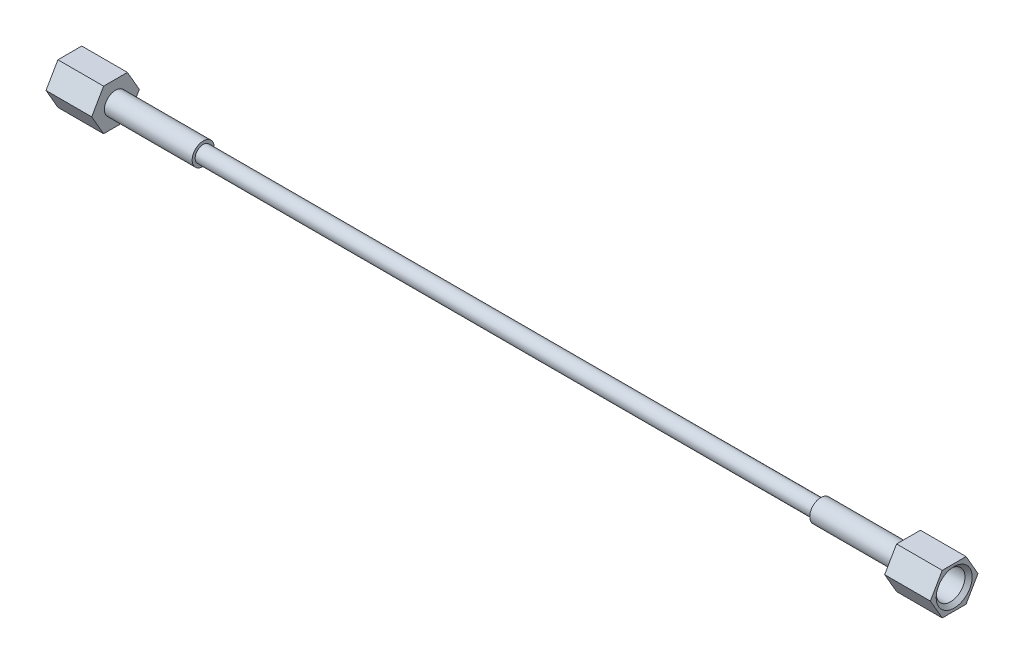
ISO-10303-21;
HEADER;
FILE_DESCRIPTION(('STEP AP214'),'2;1');
FILE_NAME('part.step','',(''),(''),'','','');
FILE_SCHEMA(('AUTOMOTIVE_DESIGN { 1 0 10303 214 1 1 1 1 }'));
ENDSEC;
DATA;
#1=APPLICATION_CONTEXT('core data for automotive mechanical design processes');
#2=APPLICATION_PROTOCOL_DEFINITION('international standard','automotive_design',2000,#1);
#3=PRODUCT_CONTEXT('',#1,'mechanical');
#4=PRODUCT('Part','Part','',(#3));
#5=PRODUCT_RELATED_PRODUCT_CATEGORY('part','',(#4));
#6=PRODUCT_DEFINITION_FORMATION('','',#4);
#7=PRODUCT_DEFINITION_CONTEXT('part definition',#1,'design');
#8=PRODUCT_DEFINITION('design','',#6,#7);
#9=PRODUCT_DEFINITION_SHAPE('','',#8);
#10=(LENGTH_UNIT() NAMED_UNIT(*) SI_UNIT(.MILLI.,.METRE.));
#11=(NAMED_UNIT(*) PLANE_ANGLE_UNIT() SI_UNIT($,.RADIAN.));
#12=(NAMED_UNIT(*) SI_UNIT($,.STERADIAN.) SOLID_ANGLE_UNIT());
#13=UNCERTAINTY_MEASURE_WITH_UNIT(LENGTH_MEASURE(1.E-05),#10,'distance_accuracy_value','');
#14=(GEOMETRIC_REPRESENTATION_CONTEXT(3) GLOBAL_UNCERTAINTY_ASSIGNED_CONTEXT((#13)) GLOBAL_UNIT_ASSIGNED_CONTEXT((#10,
#11,#12)) REPRESENTATION_CONTEXT('',''));
#15=CARTESIAN_POINT('',(0.,0.,0.));
#16=DIRECTION('',(0.,0.,1.));
#17=DIRECTION('',(1.,0.,0.));
#18=AXIS2_PLACEMENT_3D('',#15,#16,#17);
#19=CARTESIAN_POINT('',(-295.91,0.,-8.21223022895325));
#20=DIRECTION('',(0.,-0.500000000000001,0.866025403784438));
#21=DIRECTION('',(0.,-0.866025403784438,-0.500000000000001));
#22=AXIS2_PLACEMENT_3D('',#19,#20,#21);
#23=PLANE('',#22);
#24=DIRECTION('',(0.,0.866025403784438,0.500000000000001));
#25=VECTOR('',#24,1.);
#26=CARTESIAN_POINT('',(-280.162,0.,-8.21223022895325));
#27=LINE('',#26,#25);
#28=CARTESIAN_POINT('',(-280.162,0.,-8.21223022895325));
#29=VERTEX_POINT('',#28);
#30=CARTESIAN_POINT('',(-280.162,7.112,-4.10611511447662));
#31=VERTEX_POINT('',#30);
#32=EDGE_CURVE('E128',#29,#31,#27,.T.);
#33=ORIENTED_EDGE('',*,*,#32,.F.);
#34=DIRECTION('',(1.,0.,0.));
#35=VECTOR('',#34,1.);
#36=CARTESIAN_POINT('',(-295.91,0.,-8.21223022895325));
#37=LINE('',#36,#35);
#38=CARTESIAN_POINT('',(-295.91,0.,-8.21223022895325));
#39=VERTEX_POINT('',#38);
#40=EDGE_CURVE('E127',#39,#29,#37,.T.);
#41=ORIENTED_EDGE('',*,*,#40,.F.);
#42=DIRECTION('',(0.,0.866025403784438,0.500000000000001));
#43=VECTOR('',#42,1.);
#44=CARTESIAN_POINT('',(-295.91,0.,-8.21223022895325));
#45=LINE('',#44,#43);
#46=CARTESIAN_POINT('',(-295.91,7.112,-4.10611511447662));
#47=VERTEX_POINT('',#46);
#48=EDGE_CURVE('E141',#39,#47,#45,.T.);
#49=ORIENTED_EDGE('',*,*,#48,.T.);
#50=DIRECTION('',(1.,0.,0.));
#51=VECTOR('',#50,1.);
#52=CARTESIAN_POINT('',(-295.91,7.112,-4.10611511447662));
#53=LINE('',#52,#51);
#54=EDGE_CURVE('E148',#47,#31,#53,.T.);
#55=ORIENTED_EDGE('',*,*,#54,.T.);
#56=EDGE_LOOP('',(#33,#41,#49,#55));
#57=FACE_BOUND('',#56,.T.);
#58=ADVANCED_FACE('F44',(#57),#23,.F.);
#59=CARTESIAN_POINT('',(-295.91,7.112,-4.10611511447662));
#60=DIRECTION('',(0.,-1.,0.));
#61=DIRECTION('',(0.,0.,-1.));
#62=AXIS2_PLACEMENT_3D('',#59,#60,#61);
#63=PLANE('',#62);
#64=DIRECTION('',(0.,0.,1.));
#65=VECTOR('',#64,1.);
#66=CARTESIAN_POINT('',(-280.162,7.112,-4.10611511447662));
#67=LINE('',#66,#65);
#68=CARTESIAN_POINT('',(-280.162,7.112,4.10611511447661));
#69=VERTEX_POINT('',#68);
#70=EDGE_CURVE('E130',#31,#69,#67,.T.);
#71=ORIENTED_EDGE('',*,*,#70,.F.);
#72=ORIENTED_EDGE('',*,*,#54,.F.);
#73=DIRECTION('',(0.,0.,1.));
#74=VECTOR('',#73,1.);
#75=CARTESIAN_POINT('',(-295.91,7.112,-4.10611511447662));
#76=LINE('',#75,#74);
#77=CARTESIAN_POINT('',(-295.91,7.112,4.10611511447661));
#78=VERTEX_POINT('',#77);
#79=EDGE_CURVE('E93',#47,#78,#76,.T.);
#80=ORIENTED_EDGE('',*,*,#79,.T.);
#81=DIRECTION('',(1.,0.,0.));
#82=VECTOR('',#81,1.);
#83=CARTESIAN_POINT('',(-295.91,7.112,4.10611511447661));
#84=LINE('',#83,#82);
#85=EDGE_CURVE('E145',#78,#69,#84,.T.);
#86=ORIENTED_EDGE('',*,*,#85,.T.);
#87=EDGE_LOOP('',(#71,#72,#80,#86));
#88=FACE_BOUND('',#87,.T.);
#89=ADVANCED_FACE('F172',(#88),#63,.F.);
#90=CARTESIAN_POINT('',(-295.91,7.112,4.10611511447661));
#91=DIRECTION('',(0.,-0.500000000000001,-0.866025403784438));
#92=DIRECTION('',(0.,0.866025403784438,-0.500000000000001));
#93=AXIS2_PLACEMENT_3D('',#90,#91,#92);
#94=PLANE('',#93);
#95=DIRECTION('',(0.,-0.866025403784438,0.500000000000001));
#96=VECTOR('',#95,1.);
#97=CARTESIAN_POINT('',(-280.162,7.112,4.10611511447661));
#98=LINE('',#97,#96);
#99=CARTESIAN_POINT('',(-280.162,0.,8.21223022895324));
#100=VERTEX_POINT('',#99);
#101=EDGE_CURVE('E134',#69,#100,#98,.T.);
#102=ORIENTED_EDGE('',*,*,#101,.F.);
#103=ORIENTED_EDGE('',*,*,#85,.F.);
#104=DIRECTION('',(0.,-0.866025403784438,0.500000000000001));
#105=VECTOR('',#104,1.);
#106=CARTESIAN_POINT('',(-295.91,7.112,4.10611511447661));
#107=LINE('',#106,#105);
#108=CARTESIAN_POINT('',(-295.91,0.,8.21223022895324));
#109=VERTEX_POINT('',#108);
#110=EDGE_CURVE('E121',#78,#109,#107,.T.);
#111=ORIENTED_EDGE('',*,*,#110,.T.);
#112=DIRECTION('',(1.,0.,0.));
#113=VECTOR('',#112,1.);
#114=CARTESIAN_POINT('',(-295.91,0.,8.21223022895324));
#115=LINE('',#114,#113);
#116=EDGE_CURVE('E115',#109,#100,#115,.T.);
#117=ORIENTED_EDGE('',*,*,#116,.T.);
#118=EDGE_LOOP('',(#102,#103,#111,#117));
#119=FACE_BOUND('',#118,.T.);
#120=ADVANCED_FACE('F193',(#119),#94,.F.);
#121=CARTESIAN_POINT('',(-295.91,0.,8.21223022895324));
#122=DIRECTION('',(0.,0.500000000000001,-0.866025403784438));
#123=DIRECTION('',(0.,0.866025403784438,0.500000000000001));
#124=AXIS2_PLACEMENT_3D('',#121,#122,#123);
#125=PLANE('',#124);
#126=DIRECTION('',(0.,-0.866025403784438,-0.500000000000001));
#127=VECTOR('',#126,1.);
#128=CARTESIAN_POINT('',(-280.162,0.,8.21223022895324));
#129=LINE('',#128,#127);
#130=CARTESIAN_POINT('',(-280.162,-7.112,4.10611511447661));
#131=VERTEX_POINT('',#130);
#132=EDGE_CURVE('E137',#100,#131,#129,.T.);
#133=ORIENTED_EDGE('',*,*,#132,.F.);
#134=ORIENTED_EDGE('',*,*,#116,.F.);
#135=DIRECTION('',(0.,-0.866025403784438,-0.500000000000001));
#136=VECTOR('',#135,1.);
#137=CARTESIAN_POINT('',(-295.91,0.,8.21223022895324));
#138=LINE('',#137,#136);
#139=CARTESIAN_POINT('',(-295.91,-7.112,4.10611511447661));
#140=VERTEX_POINT('',#139);
#141=EDGE_CURVE('E105',#109,#140,#138,.T.);
#142=ORIENTED_EDGE('',*,*,#141,.T.);
#143=DIRECTION('',(1.,0.,0.));
#144=VECTOR('',#143,1.);
#145=CARTESIAN_POINT('',(-295.91,-7.112,4.10611511447661));
#146=LINE('',#145,#144);
#147=EDGE_CURVE('E110',#140,#131,#146,.T.);
#148=ORIENTED_EDGE('',*,*,#147,.T.);
#149=EDGE_LOOP('',(#133,#134,#142,#148));
#150=FACE_BOUND('',#149,.T.);
#151=ADVANCED_FACE('F118',(#150),#125,.F.);
#152=CARTESIAN_POINT('',(-295.91,-7.112,4.10611511447661));
#153=DIRECTION('',(0.,1.,0.));
#154=DIRECTION('',(0.,0.,1.));
#155=AXIS2_PLACEMENT_3D('',#152,#153,#154);
#156=PLANE('',#155);
#157=DIRECTION('',(0.,0.,-1.));
#158=VECTOR('',#157,1.);
#159=CARTESIAN_POINT('',(-280.162,-7.112,4.10611511447661));
#160=LINE('',#159,#158);
#161=CARTESIAN_POINT('',(-280.162,-7.112,-4.10611511447661));
#162=VERTEX_POINT('',#161);
#163=EDGE_CURVE('E112',#131,#162,#160,.T.);
#164=ORIENTED_EDGE('',*,*,#163,.F.);
#165=ORIENTED_EDGE('',*,*,#147,.F.);
#166=DIRECTION('',(0.,0.,-1.));
#167=VECTOR('',#166,1.);
#168=CARTESIAN_POINT('',(-295.91,-7.112,4.10611511447661));
#169=LINE('',#168,#167);
#170=CARTESIAN_POINT('',(-295.91,-7.112,-4.10611511447661));
#171=VERTEX_POINT('',#170);
#172=EDGE_CURVE('E101',#140,#171,#169,.T.);
#173=ORIENTED_EDGE('',*,*,#172,.T.);
#174=DIRECTION('',(1.,0.,0.));
#175=VECTOR('',#174,1.);
#176=CARTESIAN_POINT('',(-295.91,-7.112,-4.10611511447661));
#177=LINE('',#176,#175);
#178=EDGE_CURVE('E116',#171,#162,#177,.T.);
#179=ORIENTED_EDGE('',*,*,#178,.T.);
#180=EDGE_LOOP('',(#164,#165,#173,#179));
#181=FACE_BOUND('',#180,.T.);
#182=ADVANCED_FACE('F111',(#181),#156,.F.);
#183=CARTESIAN_POINT('',(-295.91,-7.112,-4.10611511447661));
#184=DIRECTION('',(0.,0.500000000000002,0.866025403784438));
#185=DIRECTION('',(0.,-0.866025403784438,0.500000000000001));
#186=AXIS2_PLACEMENT_3D('',#183,#184,#185);
#187=PLANE('',#186);
#188=DIRECTION('',(0.,0.866025403784438,-0.500000000000001));
#189=VECTOR('',#188,1.);
#190=CARTESIAN_POINT('',(-280.162,-7.112,-4.10611511447661));
#191=LINE('',#190,#189);
#192=EDGE_CURVE('E81',#162,#29,#191,.T.);
#193=ORIENTED_EDGE('',*,*,#192,.F.);
#194=ORIENTED_EDGE('',*,*,#178,.F.);
#195=DIRECTION('',(0.,0.866025403784438,-0.500000000000001));
#196=VECTOR('',#195,1.);
#197=CARTESIAN_POINT('',(-295.91,-7.112,-4.10611511447661));
#198=LINE('',#197,#196);
#199=EDGE_CURVE('E61',#171,#39,#198,.T.);
#200=ORIENTED_EDGE('',*,*,#199,.T.);
#201=ORIENTED_EDGE('',*,*,#40,.T.);
#202=EDGE_LOOP('',(#193,#194,#200,#201));
#203=FACE_BOUND('',#202,.T.);
#204=ADVANCED_FACE('F177',(#203),#187,.F.);
#205=CARTESIAN_POINT('',(-295.91,0.,-8.21223022895325));
#206=DIRECTION('',(1.,0.,0.));
#207=DIRECTION('',(0.,0.,1.));
#208=AXIS2_PLACEMENT_3D('',#205,#206,#207);
#209=PLANE('',#208);
#210=CARTESIAN_POINT('',(-295.91,0.,0.));
#211=DIRECTION('',(-1.,0.,0.));
#212=DIRECTION('',(0.,0.,1.));
#213=AXIS2_PLACEMENT_3D('',#210,#211,#212);
#214=CIRCLE('',#213,6.20077499999993);
#215=CARTESIAN_POINT('',(-295.91,0.,6.20077499999993));
#216=VERTEX_POINT('',#215);
#217=EDGE_CURVE('E12',#216,#216,#214,.T.);
#218=ORIENTED_EDGE('',*,*,#217,.F.);
#219=EDGE_LOOP('',(#218));
#220=FACE_BOUND('',#219,.T.);
#221=ORIENTED_EDGE('',*,*,#48,.F.);
#222=ORIENTED_EDGE('',*,*,#199,.F.);
#223=ORIENTED_EDGE('',*,*,#172,.F.);
#224=ORIENTED_EDGE('',*,*,#141,.F.);
#225=ORIENTED_EDGE('',*,*,#110,.F.);
#226=ORIENTED_EDGE('',*,*,#79,.F.);
#227=EDGE_LOOP('',(#221,#222,#223,#224,#225,#226));
#228=FACE_BOUND('',#227,.T.);
#229=ADVANCED_FACE('F103',(#220,#228),#209,.F.);
#230=CARTESIAN_POINT('',(-280.162,0.,-8.21223022895325));
#231=DIRECTION('',(1.,0.,0.));
#232=DIRECTION('',(0.,0.,1.));
#233=AXIS2_PLACEMENT_3D('',#230,#231,#232);
#234=PLANE('',#233);
#235=CARTESIAN_POINT('',(-280.162,0.,0.));
#236=DIRECTION('',(-1.,0.,0.));
#237=DIRECTION('',(0.,0.,1.));
#238=AXIS2_PLACEMENT_3D('',#235,#236,#237);
#239=CIRCLE('',#238,3.83540000000001);
#240=CARTESIAN_POINT('',(-280.162,0.,3.83540000000001));
#241=VERTEX_POINT('',#240);
#242=EDGE_CURVE('E131',#241,#241,#239,.T.);
#243=ORIENTED_EDGE('',*,*,#242,.T.);
#244=EDGE_LOOP('',(#243));
#245=FACE_BOUND('',#244,.T.);
#246=ORIENTED_EDGE('',*,*,#32,.T.);
#247=ORIENTED_EDGE('',*,*,#70,.T.);
#248=ORIENTED_EDGE('',*,*,#101,.T.);
#249=ORIENTED_EDGE('',*,*,#132,.T.);
#250=ORIENTED_EDGE('',*,*,#163,.T.);
#251=ORIENTED_EDGE('',*,*,#192,.T.);
#252=EDGE_LOOP('',(#246,#247,#248,#249,#250,#251));
#253=FACE_BOUND('',#252,.T.);
#254=ADVANCED_FACE('F184',(#245,#253),#234,.T.);
#255=CARTESIAN_POINT('',(-295.91,0.,0.));
#256=DIRECTION('',(-1.,0.,0.));
#257=DIRECTION('',(0.,0.,-1.));
#258=AXIS2_PLACEMENT_3D('',#255,#256,#257);
#259=CYLINDRICAL_SURFACE('',#258,3.83540000000001);
#260=CARTESIAN_POINT('',(-286.343899614258,0.,0.));
#261=DIRECTION('',(1.,0.,0.));
#262=DIRECTION('',(0.,0.,-1.));
#263=AXIS2_PLACEMENT_3D('',#260,#261,#262);
#264=CIRCLE('',#263,3.83540000000001);
#265=CARTESIAN_POINT('',(-286.343899614258,0.,-3.83540000000001));
#266=VERTEX_POINT('',#265);
#267=EDGE_CURVE('E163',#266,#266,#264,.T.);
#268=ORIENTED_EDGE('',*,*,#267,.F.);
#269=EDGE_LOOP('',(#268));
#270=FACE_BOUND('',#269,.T.);
#271=ORIENTED_EDGE('',*,*,#242,.F.);
#272=EDGE_LOOP('',(#271));
#273=FACE_BOUND('',#272,.T.);
#274=ADVANCED_FACE('F227',(#270,#273),#259,.F.);
#275=CARTESIAN_POINT('',(-287.02,0.,0.));
#276=DIRECTION('',(-1.,0.,0.));
#277=DIRECTION('',(0.,0.,-1.));
#278=AXIS2_PLACEMENT_3D('',#275,#276,#277);
#279=CONICAL_SURFACE('',#278,4.96062,1.02974425867667);
#280=ORIENTED_EDGE('',*,*,#267,.T.);
#281=EDGE_LOOP('',(#280));
#282=FACE_BOUND('',#281,.T.);
#283=CARTESIAN_POINT('',(-287.02,0.,0.));
#284=DIRECTION('',(1.,0.,0.));
#285=DIRECTION('',(0.,0.,-1.));
#286=AXIS2_PLACEMENT_3D('',#283,#284,#285);
#287=CIRCLE('',#286,4.96062);
#288=CARTESIAN_POINT('',(-287.02,0.,-4.96062));
#289=VERTEX_POINT('',#288);
#290=EDGE_CURVE('E161',#289,#289,#287,.T.);
#291=ORIENTED_EDGE('',*,*,#290,.F.);
#292=EDGE_LOOP('',(#291));
#293=FACE_BOUND('',#292,.T.);
#294=ADVANCED_FACE('F157',(#282,#293),#279,.F.);
#295=CARTESIAN_POINT('',(-295.91,0.,0.));
#296=DIRECTION('',(-1.,0.,0.));
#297=DIRECTION('',(0.,0.,-1.));
#298=AXIS2_PLACEMENT_3D('',#295,#296,#297);
#299=CYLINDRICAL_SURFACE('',#298,4.96062);
#300=CARTESIAN_POINT('',(-294.669845,0.,0.));
#301=DIRECTION('',(-1.,0.,0.));
#302=DIRECTION('',(0.,0.,1.));
#303=AXIS2_PLACEMENT_3D('',#300,#301,#302);
#304=CIRCLE('',#303,4.96062);
#305=CARTESIAN_POINT('',(-294.669845,0.,4.96062));
#306=VERTEX_POINT('',#305);
#307=EDGE_CURVE('E53',#306,#306,#304,.F.);
#308=ORIENTED_EDGE('',*,*,#307,.F.);
#309=EDGE_LOOP('',(#308));
#310=FACE_BOUND('',#309,.T.);
#311=ORIENTED_EDGE('',*,*,#290,.T.);
#312=EDGE_LOOP('',(#311));
#313=FACE_BOUND('',#312,.T.);
#314=ADVANCED_FACE('F154',(#310,#313),#299,.F.);
#315=CARTESIAN_POINT('',(-294.669845,0.,0.));
#316=DIRECTION('',(-1.,0.,0.));
#317=DIRECTION('',(0.,0.,-1.));
#318=AXIS2_PLACEMENT_3D('',#315,#316,#317);
#319=CONICAL_SURFACE('',#318,4.96062,0.785398163397451);
#320=ORIENTED_EDGE('',*,*,#217,.T.);
#321=EDGE_LOOP('',(#320));
#322=FACE_BOUND('',#321,.T.);
#323=ORIENTED_EDGE('',*,*,#307,.T.);
#324=EDGE_LOOP('',(#323));
#325=FACE_BOUND('',#324,.T.);
#326=ADVANCED_FACE('F46',(#322,#325),#319,.F.);
#327=CLOSED_SHELL('',(#58,#89,#120,#151,#182,#204,#229,#254,#274,#294,#314,#326));
#328=MANIFOLD_SOLID_BREP('B2',#327);
#329=CARTESIAN_POINT('',(-0.691362245465482,0.,0.));
#330=DIRECTION('',(-1.,0.,0.));
#331=DIRECTION('',(0.,0.,1.));
#332=AXIS2_PLACEMENT_3D('',#329,#330,#331);
#333=CYLINDRICAL_SURFACE('',#332,3.81);
#334=CARTESIAN_POINT('',(-0.691362245465465,0.,0.));
#335=DIRECTION('',(-1.,0.,0.));
#336=DIRECTION('',(0.,0.,1.));
#337=AXIS2_PLACEMENT_3D('',#334,#335,#336);
#338=CIRCLE('',#337,3.80999999999999);
#339=CARTESIAN_POINT('',(-0.691362245465465,0.,3.80999999999999));
#340=VERTEX_POINT('',#339);
#341=EDGE_CURVE('E323',#340,#340,#338,.T.);
#342=ORIENTED_EDGE('',*,*,#341,.T.);
#343=EDGE_LOOP('',(#342));
#344=FACE_BOUND('',#343,.T.);
#345=CARTESIAN_POINT('',(-37.084,0.,0.));
#346=DIRECTION('',(-1.,0.,0.));
#347=DIRECTION('',(0.,0.,1.));
#348=AXIS2_PLACEMENT_3D('',#345,#346,#347);
#349=CIRCLE('',#348,3.81);
#350=CARTESIAN_POINT('',(-37.084,0.,3.81));
#351=VERTEX_POINT('',#350);
#352=EDGE_CURVE('E43',#351,#351,#349,.T.);
#353=ORIENTED_EDGE('',*,*,#352,.F.);
#354=EDGE_LOOP('',(#353));
#355=FACE_BOUND('',#354,.T.);
#356=ADVANCED_FACE('F295',(#344,#355),#333,.T.);
#357=CARTESIAN_POINT('',(-37.084,2.76859999999997,0.));
#358=DIRECTION('',(-1.,0.,0.));
#359=DIRECTION('',(0.,0.,1.));
#360=AXIS2_PLACEMENT_3D('',#357,#358,#359);
#361=PLANE('',#360);
#362=ORIENTED_EDGE('',*,*,#352,.T.);
#363=EDGE_LOOP('',(#362));
#364=FACE_BOUND('',#363,.T.);
#365=CARTESIAN_POINT('',(-37.084,0.,0.));
#366=DIRECTION('',(-1.,0.,0.));
#367=DIRECTION('',(0.,0.,1.));
#368=AXIS2_PLACEMENT_3D('',#365,#366,#367);
#369=CIRCLE('',#368,2.76859999999997);
#370=CARTESIAN_POINT('',(-37.084,0.,2.76859999999997));
#371=VERTEX_POINT('',#370);
#372=EDGE_CURVE('E301',#371,#371,#369,.T.);
#373=ORIENTED_EDGE('',*,*,#372,.F.);
#374=EDGE_LOOP('',(#373));
#375=FACE_BOUND('',#374,.T.);
#376=ADVANCED_FACE('F341',(#364,#375),#361,.T.);
#377=CARTESIAN_POINT('',(-0.691362245465482,0.,0.));
#378=DIRECTION('',(-1.,0.,0.));
#379=DIRECTION('',(0.,0.,1.));
#380=AXIS2_PLACEMENT_3D('',#377,#378,#379);
#381=CYLINDRICAL_SURFACE('',#380,2.76859999999999);
#382=ORIENTED_EDGE('',*,*,#372,.T.);
#383=EDGE_LOOP('',(#382));
#384=FACE_BOUND('',#383,.T.);
#385=CARTESIAN_POINT('',(-249.936,0.,0.));
#386=DIRECTION('',(-1.,0.,0.));
#387=DIRECTION('',(0.,0.,1.));
#388=AXIS2_PLACEMENT_3D('',#385,#386,#387);
#389=CIRCLE('',#388,2.76860000000001);
#390=CARTESIAN_POINT('',(-249.936,0.,2.76860000000001));
#391=VERTEX_POINT('',#390);
#392=EDGE_CURVE('E305',#391,#391,#389,.T.);
#393=ORIENTED_EDGE('',*,*,#392,.F.);
#394=EDGE_LOOP('',(#393));
#395=FACE_BOUND('',#394,.T.);
#396=ADVANCED_FACE('F345',(#384,#395),#381,.T.);
#397=CARTESIAN_POINT('',(-249.936,2.76860000000001,0.));
#398=DIRECTION('',(1.,0.,0.));
#399=DIRECTION('',(0.,0.,-1.));
#400=AXIS2_PLACEMENT_3D('',#397,#398,#399);
#401=PLANE('',#400);
#402=ORIENTED_EDGE('',*,*,#392,.T.);
#403=EDGE_LOOP('',(#402));
#404=FACE_BOUND('',#403,.T.);
#405=CARTESIAN_POINT('',(-249.936,0.,0.));
#406=DIRECTION('',(-1.,0.,0.));
#407=DIRECTION('',(0.,0.,1.));
#408=AXIS2_PLACEMENT_3D('',#405,#406,#407);
#409=CIRCLE('',#408,3.81000000000002);
#410=CARTESIAN_POINT('',(-249.936,0.,3.81000000000002));
#411=VERTEX_POINT('',#410);
#412=EDGE_CURVE('E309',#411,#411,#409,.T.);
#413=ORIENTED_EDGE('',*,*,#412,.F.);
#414=EDGE_LOOP('',(#413));
#415=FACE_BOUND('',#414,.T.);
#416=ADVANCED_FACE('F349',(#404,#415),#401,.T.);
#417=CARTESIAN_POINT('',(-0.691362245465482,0.,0.));
#418=DIRECTION('',(-1.,0.,0.));
#419=DIRECTION('',(0.,0.,1.));
#420=AXIS2_PLACEMENT_3D('',#417,#418,#419);
#421=CYLINDRICAL_SURFACE('',#420,3.81000000000003);
#422=ORIENTED_EDGE('',*,*,#412,.T.);
#423=EDGE_LOOP('',(#422));
#424=FACE_BOUND('',#423,.T.);
#425=CARTESIAN_POINT('',(-286.328637754535,0.,0.));
#426=DIRECTION('',(-1.,0.,0.));
#427=DIRECTION('',(0.,0.,1.));
#428=AXIS2_PLACEMENT_3D('',#425,#426,#427);
#429=CIRCLE('',#428,3.81000000000003);
#430=CARTESIAN_POINT('',(-286.328637754535,0.,3.81000000000003));
#431=VERTEX_POINT('',#430);
#432=EDGE_CURVE('E314',#431,#431,#429,.T.);
#433=ORIENTED_EDGE('',*,*,#432,.F.);
#434=EDGE_LOOP('',(#433));
#435=FACE_BOUND('',#434,.T.);
#436=ADVANCED_FACE('F355',(#424,#435),#421,.T.);
#437=CARTESIAN_POINT('',(-284.634571325248,0.,0.));
#438=DIRECTION('',(-1.,0.,0.));
#439=DIRECTION('',(0.,0.,1.));
#440=AXIS2_PLACEMENT_3D('',#437,#438,#439);
#441=CONICAL_SURFACE('',#440,0.990600000000015,1.02974425867667);
#442=ORIENTED_EDGE('',*,*,#432,.T.);
#443=EDGE_LOOP('',(#442));
#444=FACE_BOUND('',#443,.T.);
#445=CARTESIAN_POINT('',(-284.634571325248,0.,0.));
#446=DIRECTION('',(-1.,0.,0.));
#447=DIRECTION('',(0.,0.,1.));
#448=AXIS2_PLACEMENT_3D('',#445,#446,#447);
#449=CIRCLE('',#448,0.990600000000015);
#450=CARTESIAN_POINT('',(-284.634571325248,0.,0.990600000000015));
#451=VERTEX_POINT('',#450);
#452=EDGE_CURVE('E317',#451,#451,#449,.T.);
#453=ORIENTED_EDGE('',*,*,#452,.F.);
#454=EDGE_LOOP('',(#453));
#455=FACE_BOUND('',#454,.T.);
#456=ADVANCED_FACE('F337',(#444,#455),#441,.F.);
#457=CARTESIAN_POINT('',(-0.691362245465482,0.,0.));
#458=DIRECTION('',(-1.,0.,0.));
#459=DIRECTION('',(0.,0.,1.));
#460=AXIS2_PLACEMENT_3D('',#457,#458,#459);
#461=CYLINDRICAL_SURFACE('',#460,0.990599999999998);
#462=ORIENTED_EDGE('',*,*,#452,.T.);
#463=EDGE_LOOP('',(#462));
#464=FACE_BOUND('',#463,.T.);
#465=CARTESIAN_POINT('',(-2.38542867475171,0.,0.));
#466=DIRECTION('',(-1.,0.,0.));
#467=DIRECTION('',(0.,0.,1.));
#468=AXIS2_PLACEMENT_3D('',#465,#466,#467);
#469=CIRCLE('',#468,0.99059999999998);
#470=CARTESIAN_POINT('',(-2.38542867475171,0.,0.99059999999998));
#471=VERTEX_POINT('',#470);
#472=EDGE_CURVE('E320',#471,#471,#469,.T.);
#473=ORIENTED_EDGE('',*,*,#472,.F.);
#474=EDGE_LOOP('',(#473));
#475=FACE_BOUND('',#474,.T.);
#476=ADVANCED_FACE('F331',(#464,#475),#461,.F.);
#477=CARTESIAN_POINT('',(-0.691362245465465,0.,0.));
#478=DIRECTION('',(1.,0.,0.));
#479=DIRECTION('',(0.,0.,-1.));
#480=AXIS2_PLACEMENT_3D('',#477,#478,#479);
#481=CONICAL_SURFACE('',#480,3.80999999999999,1.02974425867667);
#482=ORIENTED_EDGE('',*,*,#472,.T.);
#483=EDGE_LOOP('',(#482));
#484=FACE_BOUND('',#483,.T.);
#485=ORIENTED_EDGE('',*,*,#341,.F.);
#486=EDGE_LOOP('',(#485));
#487=FACE_BOUND('',#486,.T.);
#488=ADVANCED_FACE('F329',(#484,#487),#481,.F.);
#489=CLOSED_SHELL('',(#356,#376,#396,#416,#436,#456,#476,#488));
#490=MANIFOLD_SOLID_BREP('B6',#489);
#491=CARTESIAN_POINT('',(8.89,0.,-8.21223022895325));
#492=DIRECTION('',(0.,-0.500000000000001,0.866025403784438));
#493=DIRECTION('',(0.,-0.866025403784438,-0.500000000000001));
#494=AXIS2_PLACEMENT_3D('',#491,#492,#493);
#495=PLANE('',#494);
#496=DIRECTION('',(0.,0.866025403784438,0.500000000000001));
#497=VECTOR('',#496,1.);
#498=CARTESIAN_POINT('',(-6.858,0.,-8.21223022895325));
#499=LINE('',#498,#497);
#500=CARTESIAN_POINT('',(-6.858,0.,-8.21223022895325));
#501=VERTEX_POINT('',#500);
#502=CARTESIAN_POINT('',(-6.858,7.112,-4.10611511447662));
#503=VERTEX_POINT('',#502);
#504=EDGE_CURVE('E503',#501,#503,#499,.T.);
#505=ORIENTED_EDGE('',*,*,#504,.T.);
#506=DIRECTION('',(-1.,0.,0.));
#507=VECTOR('',#506,1.);
#508=CARTESIAN_POINT('',(8.89,7.112,-4.10611511447662));
#509=LINE('',#508,#507);
#510=CARTESIAN_POINT('',(8.89,7.112,-4.10611511447662));
#511=VERTEX_POINT('',#510);
#512=EDGE_CURVE('E521',#511,#503,#509,.T.);
#513=ORIENTED_EDGE('',*,*,#512,.F.);
#514=DIRECTION('',(0.,0.866025403784438,0.500000000000001));
#515=VECTOR('',#514,1.);
#516=CARTESIAN_POINT('',(8.89,0.,-8.21223022895325));
#517=LINE('',#516,#515);
#518=CARTESIAN_POINT('',(8.89,0.,-8.21223022895325));
#519=VERTEX_POINT('',#518);
#520=EDGE_CURVE('E514',#519,#511,#517,.T.);
#521=ORIENTED_EDGE('',*,*,#520,.F.);
#522=DIRECTION('',(-1.,0.,0.));
#523=VECTOR('',#522,1.);
#524=CARTESIAN_POINT('',(8.89,0.,-8.21223022895325));
#525=LINE('',#524,#523);
#526=EDGE_CURVE('E499',#519,#501,#525,.T.);
#527=ORIENTED_EDGE('',*,*,#526,.T.);
#528=EDGE_LOOP('',(#505,#513,#521,#527));
#529=FACE_BOUND('',#528,.T.);
#530=ADVANCED_FACE('F417',(#529),#495,.F.);
#531=CARTESIAN_POINT('',(8.89,7.112,-4.10611511447662));
#532=DIRECTION('',(0.,-1.,0.));
#533=DIRECTION('',(0.,0.,-1.));
#534=AXIS2_PLACEMENT_3D('',#531,#532,#533);
#535=PLANE('',#534);
#536=DIRECTION('',(0.,0.,1.));
#537=VECTOR('',#536,1.);
#538=CARTESIAN_POINT('',(-6.858,7.112,-4.10611511447662));
#539=LINE('',#538,#537);
#540=CARTESIAN_POINT('',(-6.858,7.112,4.10611511447661));
#541=VERTEX_POINT('',#540);
#542=EDGE_CURVE('E506',#503,#541,#539,.T.);
#543=ORIENTED_EDGE('',*,*,#542,.T.);
#544=DIRECTION('',(-1.,0.,0.));
#545=VECTOR('',#544,1.);
#546=CARTESIAN_POINT('',(8.89,7.112,4.10611511447661));
#547=LINE('',#546,#545);
#548=CARTESIAN_POINT('',(8.89,7.112,4.10611511447661));
#549=VERTEX_POINT('',#548);
#550=EDGE_CURVE('E518',#549,#541,#547,.T.);
#551=ORIENTED_EDGE('',*,*,#550,.F.);
#552=DIRECTION('',(0.,0.,1.));
#553=VECTOR('',#552,1.);
#554=CARTESIAN_POINT('',(8.89,7.112,-4.10611511447662));
#555=LINE('',#554,#553);
#556=EDGE_CURVE('E472',#511,#549,#555,.T.);
#557=ORIENTED_EDGE('',*,*,#556,.F.);
#558=ORIENTED_EDGE('',*,*,#512,.T.);
#559=EDGE_LOOP('',(#543,#551,#557,#558));
#560=FACE_BOUND('',#559,.T.);
#561=ADVANCED_FACE('F537',(#560),#535,.F.);
#562=CARTESIAN_POINT('',(8.89,7.112,4.10611511447661));
#563=DIRECTION('',(0.,-0.500000000000001,-0.866025403784438));
#564=DIRECTION('',(0.,0.866025403784438,-0.500000000000001));
#565=AXIS2_PLACEMENT_3D('',#562,#563,#564);
#566=PLANE('',#565);
#567=DIRECTION('',(0.,-0.866025403784438,0.500000000000001));
#568=VECTOR('',#567,1.);
#569=CARTESIAN_POINT('',(-6.858,7.112,4.10611511447661));
#570=LINE('',#569,#568);
#571=CARTESIAN_POINT('',(-6.858,0.,8.21223022895324));
#572=VERTEX_POINT('',#571);
#573=EDGE_CURVE('E509',#541,#572,#570,.T.);
#574=ORIENTED_EDGE('',*,*,#573,.T.);
#575=DIRECTION('',(-1.,0.,0.));
#576=VECTOR('',#575,1.);
#577=CARTESIAN_POINT('',(8.89,0.,8.21223022895324));
#578=LINE('',#577,#576);
#579=CARTESIAN_POINT('',(8.89,0.,8.21223022895324));
#580=VERTEX_POINT('',#579);
#581=EDGE_CURVE('E494',#580,#572,#578,.T.);
#582=ORIENTED_EDGE('',*,*,#581,.F.);
#583=DIRECTION('',(0.,-0.866025403784438,0.500000000000001));
#584=VECTOR('',#583,1.);
#585=CARTESIAN_POINT('',(8.89,7.112,4.10611511447661));
#586=LINE('',#585,#584);
#587=EDGE_CURVE('E485',#549,#580,#586,.T.);
#588=ORIENTED_EDGE('',*,*,#587,.F.);
#589=ORIENTED_EDGE('',*,*,#550,.T.);
#590=EDGE_LOOP('',(#574,#582,#588,#589));
#591=FACE_BOUND('',#590,.T.);
#592=ADVANCED_FACE('F542',(#591),#566,.F.);
#593=CARTESIAN_POINT('',(8.89,0.,8.21223022895324));
#594=DIRECTION('',(0.,0.500000000000001,-0.866025403784438));
#595=DIRECTION('',(0.,0.866025403784438,0.500000000000001));
#596=AXIS2_PLACEMENT_3D('',#593,#594,#595);
#597=PLANE('',#596);
#598=DIRECTION('',(0.,-0.866025403784438,-0.500000000000001));
#599=VECTOR('',#598,1.);
#600=CARTESIAN_POINT('',(-6.858,0.,8.21223022895324));
#601=LINE('',#600,#599);
#602=CARTESIAN_POINT('',(-6.858,-7.112,4.10611511447661));
#603=VERTEX_POINT('',#602);
#604=EDGE_CURVE('E493',#572,#603,#601,.T.);
#605=ORIENTED_EDGE('',*,*,#604,.T.);
#606=DIRECTION('',(-1.,0.,0.));
#607=VECTOR('',#606,1.);
#608=CARTESIAN_POINT('',(8.89,-7.112,4.10611511447661));
#609=LINE('',#608,#607);
#610=CARTESIAN_POINT('',(8.89,-7.112,4.10611511447661));
#611=VERTEX_POINT('',#610);
#612=EDGE_CURVE('E490',#611,#603,#609,.T.);
#613=ORIENTED_EDGE('',*,*,#612,.F.);
#614=DIRECTION('',(0.,-0.866025403784438,-0.500000000000001));
#615=VECTOR('',#614,1.);
#616=CARTESIAN_POINT('',(8.89,0.,8.21223022895324));
#617=LINE('',#616,#615);
#618=EDGE_CURVE('E479',#580,#611,#617,.T.);
#619=ORIENTED_EDGE('',*,*,#618,.F.);
#620=ORIENTED_EDGE('',*,*,#581,.T.);
#621=EDGE_LOOP('',(#605,#613,#619,#620));
#622=FACE_BOUND('',#621,.T.);
#623=ADVANCED_FACE('F491',(#622),#597,.F.);
#624=CARTESIAN_POINT('',(8.89,-7.112,4.10611511447661));
#625=DIRECTION('',(0.,1.,0.));
#626=DIRECTION('',(0.,0.,1.));
#627=AXIS2_PLACEMENT_3D('',#624,#625,#626);
#628=PLANE('',#627);
#629=DIRECTION('',(0.,0.,-1.));
#630=VECTOR('',#629,1.);
#631=CARTESIAN_POINT('',(-6.858,-7.112,4.10611511447661));
#632=LINE('',#631,#630);
#633=CARTESIAN_POINT('',(-6.858,-7.112,-4.10611511447661));
#634=VERTEX_POINT('',#633);
#635=EDGE_CURVE('E457',#603,#634,#632,.T.);
#636=ORIENTED_EDGE('',*,*,#635,.T.);
#637=DIRECTION('',(-1.,0.,0.));
#638=VECTOR('',#637,1.);
#639=CARTESIAN_POINT('',(8.89,-7.112,-4.10611511447661));
#640=LINE('',#639,#638);
#641=CARTESIAN_POINT('',(8.89,-7.112,-4.10611511447661));
#642=VERTEX_POINT('',#641);
#643=EDGE_CURVE('E495',#642,#634,#640,.T.);
#644=ORIENTED_EDGE('',*,*,#643,.F.);
#645=DIRECTION('',(0.,0.,-1.));
#646=VECTOR('',#645,1.);
#647=CARTESIAN_POINT('',(8.89,-7.112,4.10611511447661));
#648=LINE('',#647,#646);
#649=EDGE_CURVE('E483',#611,#642,#648,.T.);
#650=ORIENTED_EDGE('',*,*,#649,.F.);
#651=ORIENTED_EDGE('',*,*,#612,.T.);
#652=EDGE_LOOP('',(#636,#644,#650,#651));
#653=FACE_BOUND('',#652,.T.);
#654=ADVANCED_FACE('F497',(#653),#628,.F.);
#655=CARTESIAN_POINT('',(8.89,-7.112,-4.10611511447661));
#656=DIRECTION('',(0.,0.500000000000002,0.866025403784438));
#657=DIRECTION('',(0.,-0.866025403784438,0.500000000000001));
#658=AXIS2_PLACEMENT_3D('',#655,#656,#657);
#659=PLANE('',#658);
#660=DIRECTION('',(0.,0.866025403784438,-0.500000000000001));
#661=VECTOR('',#660,1.);
#662=CARTESIAN_POINT('',(-6.858,-7.112,-4.10611511447661));
#663=LINE('',#662,#661);
#664=EDGE_CURVE('E463',#634,#501,#663,.T.);
#665=ORIENTED_EDGE('',*,*,#664,.T.);
#666=ORIENTED_EDGE('',*,*,#526,.F.);
#667=DIRECTION('',(0.,0.866025403784438,-0.500000000000001));
#668=VECTOR('',#667,1.);
#669=CARTESIAN_POINT('',(8.89,-7.112,-4.10611511447661));
#670=LINE('',#669,#668);
#671=EDGE_CURVE('E434',#642,#519,#670,.T.);
#672=ORIENTED_EDGE('',*,*,#671,.F.);
#673=ORIENTED_EDGE('',*,*,#643,.T.);
#674=EDGE_LOOP('',(#665,#666,#672,#673));
#675=FACE_BOUND('',#674,.T.);
#676=ADVANCED_FACE('F552',(#675),#659,.F.);
#677=CARTESIAN_POINT('',(8.89,0.,-8.21223022895325));
#678=DIRECTION('',(-1.,0.,0.));
#679=DIRECTION('',(0.,0.,1.));
#680=AXIS2_PLACEMENT_3D('',#677,#678,#679);
#681=PLANE('',#680);
#682=CARTESIAN_POINT('',(8.89,0.,0.));
#683=DIRECTION('',(-1.,0.,0.));
#684=DIRECTION('',(0.,0.,1.));
#685=AXIS2_PLACEMENT_3D('',#682,#683,#684);
#686=CIRCLE('',#685,6.20077499999993);
#687=CARTESIAN_POINT('',(8.89,0.,6.20077499999993));
#688=VERTEX_POINT('',#687);
#689=EDGE_CURVE('E293',#688,#688,#686,.T.);
#690=ORIENTED_EDGE('',*,*,#689,.T.);
#691=EDGE_LOOP('',(#690));
#692=FACE_BOUND('',#691,.T.);
#693=ORIENTED_EDGE('',*,*,#520,.T.);
#694=ORIENTED_EDGE('',*,*,#556,.T.);
#695=ORIENTED_EDGE('',*,*,#587,.T.);
#696=ORIENTED_EDGE('',*,*,#618,.T.);
#697=ORIENTED_EDGE('',*,*,#649,.T.);
#698=ORIENTED_EDGE('',*,*,#671,.T.);
#699=EDGE_LOOP('',(#693,#694,#695,#696,#697,#698));
#700=FACE_BOUND('',#699,.T.);
#701=ADVANCED_FACE('F481',(#692,#700),#681,.F.);
#702=CARTESIAN_POINT('',(-6.858,0.,-8.21223022895325));
#703=DIRECTION('',(-1.,0.,0.));
#704=DIRECTION('',(0.,0.,1.));
#705=AXIS2_PLACEMENT_3D('',#702,#703,#704);
#706=PLANE('',#705);
#707=CARTESIAN_POINT('',(-6.858,0.,0.));
#708=DIRECTION('',(-1.,0.,0.));
#709=DIRECTION('',(0.,0.,1.));
#710=AXIS2_PLACEMENT_3D('',#707,#708,#709);
#711=CIRCLE('',#710,3.83540000000001);
#712=CARTESIAN_POINT('',(-6.858,0.,3.83540000000001));
#713=VERTEX_POINT('',#712);
#714=EDGE_CURVE('E507',#713,#713,#711,.T.);
#715=ORIENTED_EDGE('',*,*,#714,.F.);
#716=EDGE_LOOP('',(#715));
#717=FACE_BOUND('',#716,.T.);
#718=ORIENTED_EDGE('',*,*,#504,.F.);
#719=ORIENTED_EDGE('',*,*,#664,.F.);
#720=ORIENTED_EDGE('',*,*,#635,.F.);
#721=ORIENTED_EDGE('',*,*,#604,.F.);
#722=ORIENTED_EDGE('',*,*,#573,.F.);
#723=ORIENTED_EDGE('',*,*,#542,.F.);
#724=EDGE_LOOP('',(#718,#719,#720,#721,#722,#723));
#725=FACE_BOUND('',#724,.T.);
#726=ADVANCED_FACE('F555',(#717,#725),#706,.T.);
#727=CARTESIAN_POINT('',(8.89,0.,0.));
#728=DIRECTION('',(1.,0.,0.));
#729=DIRECTION('',(0.,0.,-1.));
#730=AXIS2_PLACEMENT_3D('',#727,#728,#729);
#731=CYLINDRICAL_SURFACE('',#730,3.83540000000001);
#732=CARTESIAN_POINT('',(-0.676100385742156,0.,0.));
#733=DIRECTION('',(1.,0.,0.));
#734=DIRECTION('',(0.,0.,-1.));
#735=AXIS2_PLACEMENT_3D('',#732,#733,#734);
#736=CIRCLE('',#735,3.83540000000001);
#737=CARTESIAN_POINT('',(-0.676100385742156,0.,-3.83540000000001));
#738=VERTEX_POINT('',#737);
#739=EDGE_CURVE('E573',#738,#738,#736,.T.);
#740=ORIENTED_EDGE('',*,*,#739,.T.);
#741=EDGE_LOOP('',(#740));
#742=FACE_BOUND('',#741,.T.);
#743=ORIENTED_EDGE('',*,*,#714,.T.);
#744=EDGE_LOOP('',(#743));
#745=FACE_BOUND('',#744,.T.);
#746=ADVANCED_FACE('F558',(#742,#745),#731,.F.);
#747=CARTESIAN_POINT('',(0.,0.,0.));
#748=DIRECTION('',(1.,0.,0.));
#749=DIRECTION('',(0.,0.,-1.));
#750=AXIS2_PLACEMENT_3D('',#747,#748,#749);
#751=CONICAL_SURFACE('',#750,4.96062,1.02974425867667);
#752=ORIENTED_EDGE('',*,*,#739,.F.);
#753=EDGE_LOOP('',(#752));
#754=FACE_BOUND('',#753,.T.);
#755=CARTESIAN_POINT('',(0.,0.,0.));
#756=DIRECTION('',(1.,0.,0.));
#757=DIRECTION('',(0.,0.,-1.));
#758=AXIS2_PLACEMENT_3D('',#755,#756,#757);
#759=CIRCLE('',#758,4.96062);
#760=CARTESIAN_POINT('',(0.,0.,-4.96062));
#761=VERTEX_POINT('',#760);
#762=EDGE_CURVE('E576',#761,#761,#759,.T.);
#763=ORIENTED_EDGE('',*,*,#762,.T.);
#764=EDGE_LOOP('',(#763));
#765=FACE_BOUND('',#764,.T.);
#766=ADVANCED_FACE('F533',(#754,#765),#751,.F.);
#767=CARTESIAN_POINT('',(8.89,0.,0.));
#768=DIRECTION('',(1.,0.,0.));
#769=DIRECTION('',(0.,0.,-1.));
#770=AXIS2_PLACEMENT_3D('',#767,#768,#769);
#771=CYLINDRICAL_SURFACE('',#770,4.96062);
#772=CARTESIAN_POINT('',(7.64984500000008,0.,0.));
#773=DIRECTION('',(-1.,0.,0.));
#774=DIRECTION('',(0.,0.,1.));
#775=AXIS2_PLACEMENT_3D('',#772,#773,#774);
#776=CIRCLE('',#775,4.96062);
#777=CARTESIAN_POINT('',(7.64984500000008,0.,4.96062));
#778=VERTEX_POINT('',#777);
#779=EDGE_CURVE('E426',#778,#778,#776,.F.);
#780=ORIENTED_EDGE('',*,*,#779,.T.);
#781=EDGE_LOOP('',(#780));
#782=FACE_BOUND('',#781,.T.);
#783=ORIENTED_EDGE('',*,*,#762,.F.);
#784=EDGE_LOOP('',(#783));
#785=FACE_BOUND('',#784,.T.);
#786=ADVANCED_FACE('F525',(#782,#785),#771,.F.);
#787=CARTESIAN_POINT('',(7.64984500000008,0.,0.));
#788=DIRECTION('',(1.,0.,0.));
#789=DIRECTION('',(0.,0.,-1.));
#790=AXIS2_PLACEMENT_3D('',#787,#788,#789);
#791=CONICAL_SURFACE('',#790,4.96062,0.785398163397451);
#792=ORIENTED_EDGE('',*,*,#689,.F.);
#793=EDGE_LOOP('',(#792));
#794=FACE_BOUND('',#793,.T.);
#795=ORIENTED_EDGE('',*,*,#779,.F.);
#796=EDGE_LOOP('',(#795));
#797=FACE_BOUND('',#796,.T.);
#798=ADVANCED_FACE('F419',(#794,#797),#791,.F.);
#799=CLOSED_SHELL('',(#530,#561,#592,#623,#654,#676,#701,#726,#746,#766,#786,#798));
#800=MANIFOLD_SOLID_BREP('B38',#799);
#801=ADVANCED_BREP_SHAPE_REPRESENTATION('',(#18,#328,#490,#800),#14);
#802=SHAPE_DEFINITION_REPRESENTATION(#9,#801);
ENDSEC;
END-ISO-10303-21;
